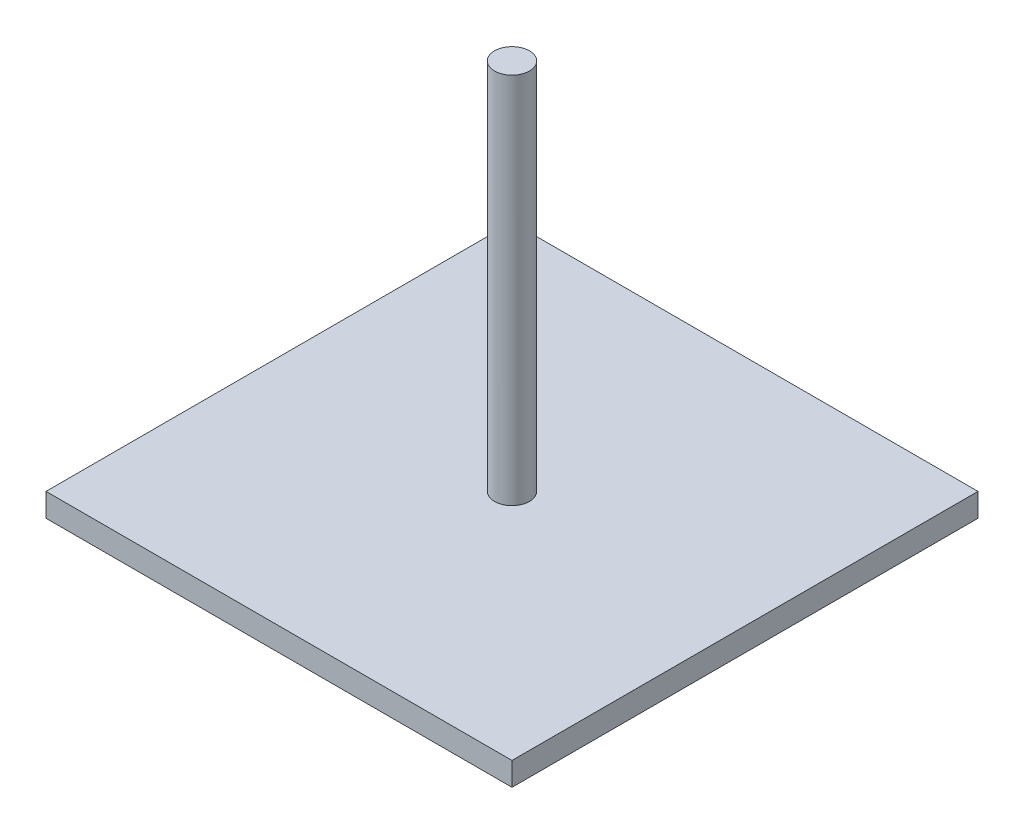
ISO-10303-21;
HEADER;
FILE_DESCRIPTION(('STEP AP214'),'2;1');
FILE_NAME('part.step','',(''),(''),'','','');
FILE_SCHEMA(('AUTOMOTIVE_DESIGN { 1 0 10303 214 1 1 1 1 }'));
ENDSEC;
DATA;
#1=APPLICATION_CONTEXT('core data for automotive mechanical design processes');
#2=APPLICATION_PROTOCOL_DEFINITION('international standard','automotive_design',2000,#1);
#3=PRODUCT_CONTEXT('',#1,'mechanical');
#4=PRODUCT('Part','Part','',(#3));
#5=PRODUCT_RELATED_PRODUCT_CATEGORY('part','',(#4));
#6=PRODUCT_DEFINITION_FORMATION('','',#4);
#7=PRODUCT_DEFINITION_CONTEXT('part definition',#1,'design');
#8=PRODUCT_DEFINITION('design','',#6,#7);
#9=PRODUCT_DEFINITION_SHAPE('','',#8);
#10=(LENGTH_UNIT() NAMED_UNIT(*) SI_UNIT(.MILLI.,.METRE.));
#11=(NAMED_UNIT(*) PLANE_ANGLE_UNIT() SI_UNIT($,.RADIAN.));
#12=(NAMED_UNIT(*) SI_UNIT($,.STERADIAN.) SOLID_ANGLE_UNIT());
#13=UNCERTAINTY_MEASURE_WITH_UNIT(LENGTH_MEASURE(1.E-05),#10,'distance_accuracy_value','');
#14=(GEOMETRIC_REPRESENTATION_CONTEXT(3) GLOBAL_UNCERTAINTY_ASSIGNED_CONTEXT((#13)) GLOBAL_UNIT_ASSIGNED_CONTEXT((#10,
#11,#12)) REPRESENTATION_CONTEXT('',''));
#15=CARTESIAN_POINT('',(0.,0.,0.));
#16=DIRECTION('',(0.,0.,1.));
#17=DIRECTION('',(1.,0.,0.));
#18=AXIS2_PLACEMENT_3D('',#15,#16,#17);
#19=CARTESIAN_POINT('',(63.5,6.35,63.5));
#20=DIRECTION('',(-1.,0.,0.));
#21=DIRECTION('',(0.,0.,1.));
#22=AXIS2_PLACEMENT_3D('',#19,#20,#21);
#23=PLANE('',#22);
#24=DIRECTION('',(0.,0.,-1.));
#25=VECTOR('',#24,1.);
#26=CARTESIAN_POINT('',(63.5,0.,63.5));
#27=LINE('',#26,#25);
#28=CARTESIAN_POINT('',(63.5,0.,63.5));
#29=VERTEX_POINT('',#28);
#30=CARTESIAN_POINT('',(63.5,0.,-63.5));
#31=VERTEX_POINT('',#30);
#32=EDGE_CURVE('E100',#29,#31,#27,.T.);
#33=ORIENTED_EDGE('',*,*,#32,.T.);
#34=DIRECTION('',(0.,-1.,0.));
#35=VECTOR('',#34,1.);
#36=CARTESIAN_POINT('',(63.5,6.35,-63.5));
#37=LINE('',#36,#35);
#38=CARTESIAN_POINT('',(63.5,6.35,-63.5));
#39=VERTEX_POINT('',#38);
#40=EDGE_CURVE('E42',#39,#31,#37,.T.);
#41=ORIENTED_EDGE('',*,*,#40,.F.);
#42=DIRECTION('',(0.,0.,-1.));
#43=VECTOR('',#42,1.);
#44=CARTESIAN_POINT('',(63.5,6.35,63.5));
#45=LINE('',#44,#43);
#46=CARTESIAN_POINT('',(63.5,6.35,63.5));
#47=VERTEX_POINT('',#46);
#48=EDGE_CURVE('E86',#47,#39,#45,.T.);
#49=ORIENTED_EDGE('',*,*,#48,.F.);
#50=DIRECTION('',(0.,-1.,0.));
#51=VECTOR('',#50,1.);
#52=CARTESIAN_POINT('',(63.5,6.35,63.5));
#53=LINE('',#52,#51);
#54=EDGE_CURVE('E96',#47,#29,#53,.T.);
#55=ORIENTED_EDGE('',*,*,#54,.T.);
#56=EDGE_LOOP('',(#33,#41,#49,#55));
#57=FACE_BOUND('',#56,.T.);
#58=ADVANCED_FACE('F34',(#57),#23,.F.);
#59=CARTESIAN_POINT('',(-63.5,6.35,-63.5));
#60=DIRECTION('',(0.,0.,1.));
#61=DIRECTION('',(1.,0.,0.));
#62=AXIS2_PLACEMENT_3D('',#59,#60,#61);
#63=PLANE('',#62);
#64=DIRECTION('',(-1.,0.,0.));
#65=VECTOR('',#64,1.);
#66=CARTESIAN_POINT('',(-63.5,0.,-63.5));
#67=LINE('',#66,#65);
#68=CARTESIAN_POINT('',(-63.5,0.,-63.5));
#69=VERTEX_POINT('',#68);
#70=EDGE_CURVE('E91',#31,#69,#67,.T.);
#71=ORIENTED_EDGE('',*,*,#70,.T.);
#72=DIRECTION('',(0.,-1.,0.));
#73=VECTOR('',#72,1.);
#74=CARTESIAN_POINT('',(-63.5,6.35,-63.5));
#75=LINE('',#74,#73);
#76=CARTESIAN_POINT('',(-63.5,6.35,-63.5));
#77=VERTEX_POINT('',#76);
#78=EDGE_CURVE('E89',#77,#69,#75,.T.);
#79=ORIENTED_EDGE('',*,*,#78,.F.);
#80=DIRECTION('',(-1.,0.,0.));
#81=VECTOR('',#80,1.);
#82=CARTESIAN_POINT('',(-63.5,6.35,-63.5));
#83=LINE('',#82,#81);
#84=EDGE_CURVE('E81',#39,#77,#83,.T.);
#85=ORIENTED_EDGE('',*,*,#84,.F.);
#86=ORIENTED_EDGE('',*,*,#40,.T.);
#87=EDGE_LOOP('',(#71,#79,#85,#86));
#88=FACE_BOUND('',#87,.T.);
#89=ADVANCED_FACE('F90',(#88),#63,.F.);
#90=CARTESIAN_POINT('',(-63.5,6.35,63.5));
#91=DIRECTION('',(1.,0.,0.));
#92=DIRECTION('',(0.,0.,-1.));
#93=AXIS2_PLACEMENT_3D('',#90,#91,#92);
#94=PLANE('',#93);
#95=DIRECTION('',(0.,0.,1.));
#96=VECTOR('',#95,1.);
#97=CARTESIAN_POINT('',(-63.5,0.,63.5));
#98=LINE('',#97,#96);
#99=CARTESIAN_POINT('',(-63.5,0.,63.5));
#100=VERTEX_POINT('',#99);
#101=EDGE_CURVE('E67',#69,#100,#98,.T.);
#102=ORIENTED_EDGE('',*,*,#101,.T.);
#103=DIRECTION('',(0.,-1.,0.));
#104=VECTOR('',#103,1.);
#105=CARTESIAN_POINT('',(-63.5,6.35,63.5));
#106=LINE('',#105,#104);
#107=CARTESIAN_POINT('',(-63.5,6.35,63.5));
#108=VERTEX_POINT('',#107);
#109=EDGE_CURVE('E92',#108,#100,#106,.T.);
#110=ORIENTED_EDGE('',*,*,#109,.F.);
#111=DIRECTION('',(0.,0.,1.));
#112=VECTOR('',#111,1.);
#113=CARTESIAN_POINT('',(-63.5,6.35,63.5));
#114=LINE('',#113,#112);
#115=EDGE_CURVE('E84',#77,#108,#114,.T.);
#116=ORIENTED_EDGE('',*,*,#115,.F.);
#117=ORIENTED_EDGE('',*,*,#78,.T.);
#118=EDGE_LOOP('',(#102,#110,#116,#117));
#119=FACE_BOUND('',#118,.T.);
#120=ADVANCED_FACE('F94',(#119),#94,.F.);
#121=CARTESIAN_POINT('',(-63.5,6.35,63.5));
#122=DIRECTION('',(0.,0.,-1.));
#123=DIRECTION('',(-1.,0.,0.));
#124=AXIS2_PLACEMENT_3D('',#121,#122,#123);
#125=PLANE('',#124);
#126=DIRECTION('',(1.,0.,0.));
#127=VECTOR('',#126,1.);
#128=CARTESIAN_POINT('',(-63.5,0.,63.5));
#129=LINE('',#128,#127);
#130=EDGE_CURVE('E73',#100,#29,#129,.T.);
#131=ORIENTED_EDGE('',*,*,#130,.T.);
#132=ORIENTED_EDGE('',*,*,#54,.F.);
#133=DIRECTION('',(1.,0.,0.));
#134=VECTOR('',#133,1.);
#135=CARTESIAN_POINT('',(-63.5,6.35,63.5));
#136=LINE('',#135,#134);
#137=EDGE_CURVE('E50',#108,#47,#136,.T.);
#138=ORIENTED_EDGE('',*,*,#137,.F.);
#139=ORIENTED_EDGE('',*,*,#109,.T.);
#140=EDGE_LOOP('',(#131,#132,#138,#139));
#141=FACE_BOUND('',#140,.T.);
#142=ADVANCED_FACE('F122',(#141),#125,.F.);
#143=CARTESIAN_POINT('',(0.,6.35,0.));
#144=DIRECTION('',(0.,-1.,0.));
#145=DIRECTION('',(0.,0.,-1.));
#146=AXIS2_PLACEMENT_3D('',#143,#144,#145);
#147=PLANE('',#146);
#148=CARTESIAN_POINT('',(0.,6.34999999999999,0.));
#149=DIRECTION('',(0.,-1.,0.));
#150=DIRECTION('',(0.,0.,-1.));
#151=AXIS2_PLACEMENT_3D('',#148,#149,#150);
#152=CIRCLE('',#151,4.7625);
#153=CARTESIAN_POINT('',(0.,6.34999999999999,-4.7625));
#154=VERTEX_POINT('',#153);
#155=EDGE_CURVE('E11',#154,#154,#152,.F.);
#156=ORIENTED_EDGE('',*,*,#155,.F.);
#157=EDGE_LOOP('',(#156));
#158=FACE_BOUND('',#157,.T.);
#159=ORIENTED_EDGE('',*,*,#48,.T.);
#160=ORIENTED_EDGE('',*,*,#84,.T.);
#161=ORIENTED_EDGE('',*,*,#115,.T.);
#162=ORIENTED_EDGE('',*,*,#137,.T.);
#163=EDGE_LOOP('',(#159,#160,#161,#162));
#164=FACE_BOUND('',#163,.T.);
#165=ADVANCED_FACE('F82',(#158,#164),#147,.F.);
#166=CARTESIAN_POINT('',(0.,0.,0.));
#167=DIRECTION('',(0.,-1.,0.));
#168=DIRECTION('',(0.,0.,-1.));
#169=AXIS2_PLACEMENT_3D('',#166,#167,#168);
#170=PLANE('',#169);
#171=ORIENTED_EDGE('',*,*,#32,.F.);
#172=ORIENTED_EDGE('',*,*,#130,.F.);
#173=ORIENTED_EDGE('',*,*,#101,.F.);
#174=ORIENTED_EDGE('',*,*,#70,.F.);
#175=EDGE_LOOP('',(#171,#172,#173,#174));
#176=FACE_BOUND('',#175,.T.);
#177=ADVANCED_FACE('F111',(#176),#170,.T.);
#178=CARTESIAN_POINT('',(0.,107.95,0.));
#179=DIRECTION('',(0.,-1.,0.));
#180=DIRECTION('',(0.,0.,-1.));
#181=AXIS2_PLACEMENT_3D('',#178,#179,#180);
#182=CYLINDRICAL_SURFACE('',#181,4.7625);
#183=CARTESIAN_POINT('',(0.,107.95,0.));
#184=DIRECTION('',(0.,1.,0.));
#185=DIRECTION('',(0.,0.,1.));
#186=AXIS2_PLACEMENT_3D('',#183,#184,#185);
#187=CIRCLE('',#186,4.7625);
#188=CARTESIAN_POINT('',(0.,107.95,4.7625));
#189=VERTEX_POINT('',#188);
#190=EDGE_CURVE('E103',#189,#189,#187,.T.);
#191=ORIENTED_EDGE('',*,*,#190,.F.);
#192=EDGE_LOOP('',(#191));
#193=FACE_BOUND('',#192,.T.);
#194=ORIENTED_EDGE('',*,*,#155,.T.);
#195=EDGE_LOOP('',(#194));
#196=FACE_BOUND('',#195,.T.);
#197=ADVANCED_FACE('F113',(#193,#196),#182,.T.);
#198=CARTESIAN_POINT('',(0.,107.95,0.));
#199=DIRECTION('',(0.,1.,0.));
#200=DIRECTION('',(0.,0.,1.));
#201=AXIS2_PLACEMENT_3D('',#198,#199,#200);
#202=PLANE('',#201);
#203=ORIENTED_EDGE('',*,*,#190,.T.);
#204=EDGE_LOOP('',(#203));
#205=FACE_BOUND('',#204,.T.);
#206=ADVANCED_FACE('F119',(#205),#202,.T.);
#207=CLOSED_SHELL('',(#58,#89,#120,#142,#165,#177,#197,#206));
#208=MANIFOLD_SOLID_BREP('B2',#207);
#209=ADVANCED_BREP_SHAPE_REPRESENTATION('',(#18,#208),#14);
#210=SHAPE_DEFINITION_REPRESENTATION(#9,#209);
ENDSEC;
END-ISO-10303-21;
